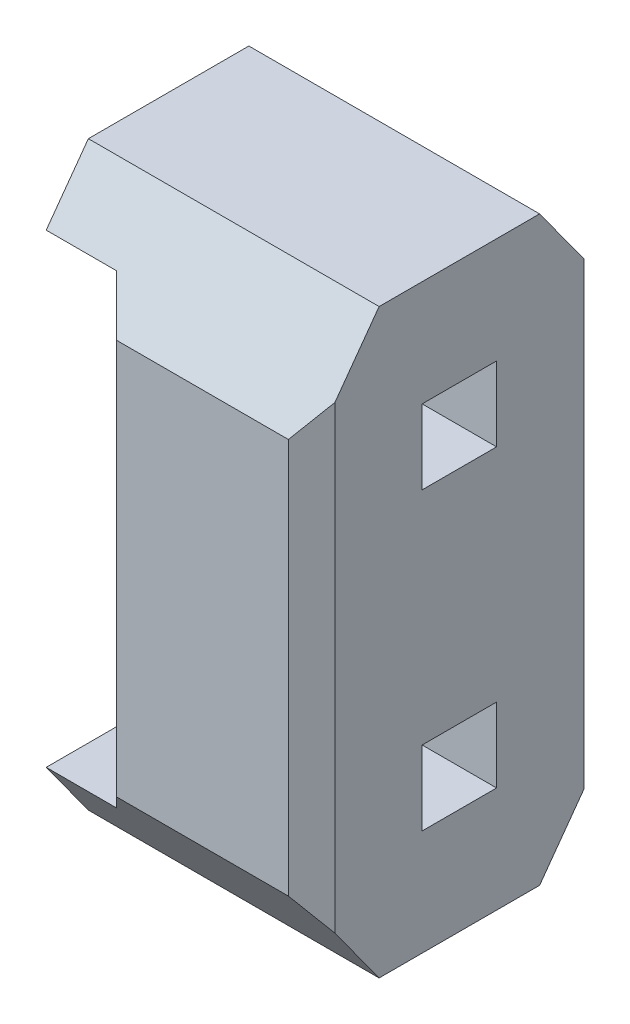
ISO-10303-21;
HEADER;
FILE_DESCRIPTION(('STEP AP214'),'2;1');
FILE_NAME('part.step','',(''),(''),'','','');
FILE_SCHEMA(('AUTOMOTIVE_DESIGN { 1 0 10303 214 1 1 1 1 }'));
ENDSEC;
DATA;
#1=APPLICATION_CONTEXT('core data for automotive mechanical design processes');
#2=APPLICATION_PROTOCOL_DEFINITION('international standard','automotive_design',2000,#1);
#3=PRODUCT_CONTEXT('',#1,'mechanical');
#4=PRODUCT('Part','Part','',(#3));
#5=PRODUCT_RELATED_PRODUCT_CATEGORY('part','',(#4));
#6=PRODUCT_DEFINITION_FORMATION('','',#4);
#7=PRODUCT_DEFINITION_CONTEXT('part definition',#1,'design');
#8=PRODUCT_DEFINITION('design','',#6,#7);
#9=PRODUCT_DEFINITION_SHAPE('','',#8);
#10=(LENGTH_UNIT() NAMED_UNIT(*) SI_UNIT(.MILLI.,.METRE.));
#11=(NAMED_UNIT(*) PLANE_ANGLE_UNIT() SI_UNIT($,.RADIAN.));
#12=(NAMED_UNIT(*) SI_UNIT($,.STERADIAN.) SOLID_ANGLE_UNIT());
#13=UNCERTAINTY_MEASURE_WITH_UNIT(LENGTH_MEASURE(1.E-05),#10,'distance_accuracy_value','');
#14=(GEOMETRIC_REPRESENTATION_CONTEXT(3) GLOBAL_UNCERTAINTY_ASSIGNED_CONTEXT((#13)) GLOBAL_UNIT_ASSIGNED_CONTEXT((#10,
#11,#12)) REPRESENTATION_CONTEXT('',''));
#15=CARTESIAN_POINT('',(0.,0.,0.));
#16=DIRECTION('',(0.,0.,1.));
#17=DIRECTION('',(1.,0.,0.));
#18=AXIS2_PLACEMENT_3D('',#15,#16,#17);
#19=CARTESIAN_POINT('',(1.25,4.6,-5.37));
#20=DIRECTION('',(0.,0.586967571460905,0.809610443394407));
#21=DIRECTION('',(0.,-0.809610443394407,0.586967571460905));
#22=AXIS2_PLACEMENT_3D('',#19,#20,#21);
#23=PLANE('',#22);
#24=DIRECTION('',(1.,0.,0.));
#25=VECTOR('',#24,1.);
#26=CARTESIAN_POINT('',(1.25,4.5,-5.2975));
#27=LINE('',#26,#25);
#28=CARTESIAN_POINT('',(0.,4.5,-5.2975));
#29=VERTEX_POINT('',#28);
#30=CARTESIAN_POINT('',(0.602500000000036,4.5,-5.29750000000004));
#31=VERTEX_POINT('',#30);
#32=EDGE_CURVE('E199',#29,#31,#27,.T.);
#33=ORIENTED_EDGE('',*,*,#32,.T.);
#34=DIRECTION('',(0.506207656349388,-0.698217457033655,0.506207656349364));
#35=VECTOR('',#34,1.);
#36=CARTESIAN_POINT('',(0.6025,4.5,-5.2975));
#37=LINE('',#36,#35);
#38=CARTESIAN_POINT('',(0.819999999999963,4.2,-5.07999999999997));
#39=VERTEX_POINT('',#38);
#40=EDGE_CURVE('E197',#31,#39,#37,.T.);
#41=ORIENTED_EDGE('',*,*,#40,.T.);
#42=DIRECTION('',(1.,0.,0.));
#43=VECTOR('',#42,1.);
#44=CARTESIAN_POINT('',(1.25,4.19999999999999,-5.08000000000001));
#45=LINE('',#44,#43);
#46=CARTESIAN_POINT('',(2.3,4.2,-5.08000000000001));
#47=VERTEX_POINT('',#46);
#48=EDGE_CURVE('E20',#39,#47,#45,.T.);
#49=ORIENTED_EDGE('',*,*,#48,.T.);
#50=DIRECTION('',(0.506207656348957,0.698217457033859,-0.506207656349514));
#51=VECTOR('',#50,1.);
#52=CARTESIAN_POINT('',(2.3,4.19999999999999,-5.08000000000001));
#53=LINE('',#52,#51);
#54=CARTESIAN_POINT('',(2.5,4.47586206896591,-5.28000000000012));
#55=VERTEX_POINT('',#54);
#56=EDGE_CURVE('E181',#47,#55,#53,.T.);
#57=ORIENTED_EDGE('',*,*,#56,.T.);
#58=DIRECTION('',(0.,-0.809610443394407,0.586967571460905));
#59=VECTOR('',#58,1.);
#60=CARTESIAN_POINT('',(2.5,4.6,-5.37));
#61=LINE('',#60,#59);
#62=CARTESIAN_POINT('',(2.5,5.,-5.65999999999999));
#63=VERTEX_POINT('',#62);
#64=EDGE_CURVE('E188',#55,#63,#61,.F.);
#65=ORIENTED_EDGE('',*,*,#64,.T.);
#66=DIRECTION('',(1.,0.,0.));
#67=VECTOR('',#66,1.);
#68=CARTESIAN_POINT('',(1.25,5.,-5.66));
#69=LINE('',#68,#67);
#70=CARTESIAN_POINT('',(0.,5.,-5.65999999999999));
#71=VERTEX_POINT('',#70);
#72=EDGE_CURVE('E215',#71,#63,#69,.T.);
#73=ORIENTED_EDGE('',*,*,#72,.F.);
#74=DIRECTION('',(0.,-0.809610443394407,0.586967571460905));
#75=VECTOR('',#74,1.);
#76=CARTESIAN_POINT('',(0.,4.6,-5.37));
#77=LINE('',#76,#75);
#78=EDGE_CURVE('E207',#71,#29,#77,.T.);
#79=ORIENTED_EDGE('',*,*,#78,.T.);
#80=EDGE_LOOP('',(#33,#41,#49,#57,#65,#73,#79));
#81=FACE_BOUND('',#80,.T.);
#82=ADVANCED_FACE('F17',(#81),#23,.T.);
#83=CARTESIAN_POINT('',(1.25,4.6,-7.33));
#84=DIRECTION('',(0.,-0.586967571460905,0.809610443394407));
#85=DIRECTION('',(0.,-0.809610443394407,-0.586967571460905));
#86=AXIS2_PLACEMENT_3D('',#83,#84,#85);
#87=PLANE('',#86);
#88=DIRECTION('',(0.,-0.809610443394407,-0.586967571460905));
#89=VECTOR('',#88,1.);
#90=CARTESIAN_POINT('',(0.,4.6,-7.33));
#91=LINE('',#90,#89);
#92=CARTESIAN_POINT('',(0.,5.,-7.04000000000001));
#93=VERTEX_POINT('',#92);
#94=CARTESIAN_POINT('',(0.,4.5,-7.4025));
#95=VERTEX_POINT('',#94);
#96=EDGE_CURVE('E263',#93,#95,#91,.T.);
#97=ORIENTED_EDGE('',*,*,#96,.F.);
#98=DIRECTION('',(1.,0.,0.));
#99=VECTOR('',#98,1.);
#100=CARTESIAN_POINT('',(1.25,5.,-7.04));
#101=LINE('',#100,#99);
#102=CARTESIAN_POINT('',(2.5,5.,-7.04));
#103=VERTEX_POINT('',#102);
#104=EDGE_CURVE('E227',#103,#93,#101,.F.);
#105=ORIENTED_EDGE('',*,*,#104,.F.);
#106=DIRECTION('',(0.,-0.809610443394407,-0.586967571460905));
#107=VECTOR('',#106,1.);
#108=CARTESIAN_POINT('',(2.5,4.6,-7.33));
#109=LINE('',#108,#107);
#110=CARTESIAN_POINT('',(2.5,4.47586206896592,-7.41999999999988));
#111=VERTEX_POINT('',#110);
#112=EDGE_CURVE('E223',#111,#103,#109,.F.);
#113=ORIENTED_EDGE('',*,*,#112,.F.);
#114=DIRECTION('',(0.506207656348956,0.69821745703386,0.506207656349513));
#115=VECTOR('',#114,1.);
#116=CARTESIAN_POINT('',(2.3,4.19999999999999,-7.61999999999999));
#117=LINE('',#116,#115);
#118=CARTESIAN_POINT('',(2.3,4.2,-7.61999999999999));
#119=VERTEX_POINT('',#118);
#120=EDGE_CURVE('E266',#119,#111,#117,.T.);
#121=ORIENTED_EDGE('',*,*,#120,.F.);
#122=DIRECTION('',(1.,0.,0.));
#123=VECTOR('',#122,1.);
#124=CARTESIAN_POINT('',(1.25,4.19999999999999,-7.61999999999999));
#125=LINE('',#124,#123);
#126=CARTESIAN_POINT('',(0.819999999999963,4.2,-7.62000000000003));
#127=VERTEX_POINT('',#126);
#128=EDGE_CURVE('E205',#127,#119,#125,.T.);
#129=ORIENTED_EDGE('',*,*,#128,.F.);
#130=DIRECTION('',(0.506207656349388,-0.698217457033654,-0.506207656349365));
#131=VECTOR('',#130,1.);
#132=CARTESIAN_POINT('',(0.6025,4.5,-7.4025));
#133=LINE('',#132,#131);
#134=CARTESIAN_POINT('',(0.602500000000036,4.5,-7.40249999999996));
#135=VERTEX_POINT('',#134);
#136=EDGE_CURVE('E203',#135,#127,#133,.T.);
#137=ORIENTED_EDGE('',*,*,#136,.F.);
#138=DIRECTION('',(1.,0.,0.));
#139=VECTOR('',#138,1.);
#140=CARTESIAN_POINT('',(1.25,4.5,-7.4025));
#141=LINE('',#140,#139);
#142=EDGE_CURVE('E261',#95,#135,#141,.T.);
#143=ORIENTED_EDGE('',*,*,#142,.F.);
#144=EDGE_LOOP('',(#97,#105,#113,#121,#129,#137,#143));
#145=FACE_BOUND('',#144,.T.);
#146=ADVANCED_FACE('F285',(#145),#87,.F.);
#147=CARTESIAN_POINT('',(1.25,0.4,-7.33));
#148=DIRECTION('',(0.,0.586967571460905,0.809610443394407));
#149=DIRECTION('',(0.,-0.809610443394407,0.586967571460905));
#150=AXIS2_PLACEMENT_3D('',#147,#148,#149);
#151=PLANE('',#150);
#152=DIRECTION('',(-0.506207656349404,0.698217457033647,-0.506207656349359));
#153=VECTOR('',#152,1.);
#154=CARTESIAN_POINT('',(2.5,0.524137931034497,-7.42));
#155=LINE('',#154,#153);
#156=CARTESIAN_POINT('',(2.5,0.524137931034498,-7.42));
#157=VERTEX_POINT('',#156);
#158=CARTESIAN_POINT('',(2.3,0.800000000000004,-7.61999999999999));
#159=VERTEX_POINT('',#158);
#160=EDGE_CURVE('E251',#157,#159,#155,.T.);
#161=ORIENTED_EDGE('',*,*,#160,.F.);
#162=DIRECTION('',(0.,-0.809610443394407,0.586967571460905));
#163=VECTOR('',#162,1.);
#164=CARTESIAN_POINT('',(2.5,0.4,-7.33));
#165=LINE('',#164,#163);
#166=CARTESIAN_POINT('',(2.5,0.,-7.04));
#167=VERTEX_POINT('',#166);
#168=EDGE_CURVE('E253',#167,#157,#165,.F.);
#169=ORIENTED_EDGE('',*,*,#168,.F.);
#170=DIRECTION('',(1.,0.,0.));
#171=VECTOR('',#170,1.);
#172=CARTESIAN_POINT('',(1.25,0.,-7.04));
#173=LINE('',#172,#171);
#174=CARTESIAN_POINT('',(0.,0.,-7.04000000000001));
#175=VERTEX_POINT('',#174);
#176=EDGE_CURVE('E288',#167,#175,#173,.F.);
#177=ORIENTED_EDGE('',*,*,#176,.T.);
#178=DIRECTION('',(0.,-0.809610443394407,0.586967571460905));
#179=VECTOR('',#178,1.);
#180=CARTESIAN_POINT('',(0.,0.4,-7.33));
#181=LINE('',#180,#179);
#182=CARTESIAN_POINT('',(0.,0.500000000000001,-7.4025));
#183=VERTEX_POINT('',#182);
#184=EDGE_CURVE('E255',#183,#175,#181,.T.);
#185=ORIENTED_EDGE('',*,*,#184,.F.);
#186=DIRECTION('',(1.,0.,0.));
#187=VECTOR('',#186,1.);
#188=CARTESIAN_POINT('',(1.25,0.500000000000002,-7.4025));
#189=LINE('',#188,#187);
#190=CARTESIAN_POINT('',(0.602500000000036,0.500000000000001,-7.40249999999996));
#191=VERTEX_POINT('',#190);
#192=EDGE_CURVE('E257',#191,#183,#189,.F.);
#193=ORIENTED_EDGE('',*,*,#192,.F.);
#194=DIRECTION('',(-0.506207656349388,-0.698217457033655,0.506207656349364));
#195=VECTOR('',#194,1.);
#196=CARTESIAN_POINT('',(0.82,0.800000000000009,-7.61999999999999));
#197=LINE('',#196,#195);
#198=CARTESIAN_POINT('',(0.819999999999963,0.800000000000004,-7.62000000000003));
#199=VERTEX_POINT('',#198);
#200=EDGE_CURVE('E259',#199,#191,#197,.T.);
#201=ORIENTED_EDGE('',*,*,#200,.F.);
#202=DIRECTION('',(1.,0.,0.));
#203=VECTOR('',#202,1.);
#204=CARTESIAN_POINT('',(1.25,0.800000000000009,-7.61999999999999));
#205=LINE('',#204,#203);
#206=EDGE_CURVE('E249',#159,#199,#205,.F.);
#207=ORIENTED_EDGE('',*,*,#206,.F.);
#208=EDGE_LOOP('',(#161,#169,#177,#185,#193,#201,#207));
#209=FACE_BOUND('',#208,.T.);
#210=ADVANCED_FACE('F431',(#209),#151,.F.);
#211=CARTESIAN_POINT('',(1.25,0.4,-5.37));
#212=DIRECTION('',(0.,-0.586967571460905,0.809610443394407));
#213=DIRECTION('',(0.,-0.809610443394407,-0.586967571460905));
#214=AXIS2_PLACEMENT_3D('',#211,#212,#213);
#215=PLANE('',#214);
#216=DIRECTION('',(1.,0.,0.));
#217=VECTOR('',#216,1.);
#218=CARTESIAN_POINT('',(1.25,0.80000000000001,-5.08000000000001));
#219=LINE('',#218,#217);
#220=CARTESIAN_POINT('',(2.3,0.800000000000004,-5.08000000000001));
#221=VERTEX_POINT('',#220);
#222=CARTESIAN_POINT('',(0.819999999999963,0.800000000000005,-5.07999999999997));
#223=VERTEX_POINT('',#222);
#224=EDGE_CURVE('E191',#221,#223,#219,.F.);
#225=ORIENTED_EDGE('',*,*,#224,.T.);
#226=DIRECTION('',(-0.506207656349388,-0.698217457033655,-0.506207656349365));
#227=VECTOR('',#226,1.);
#228=CARTESIAN_POINT('',(0.82,0.80000000000001,-5.08000000000001));
#229=LINE('',#228,#227);
#230=CARTESIAN_POINT('',(0.602500000000036,0.500000000000001,-5.29750000000004));
#231=VERTEX_POINT('',#230);
#232=EDGE_CURVE('E232',#223,#231,#229,.T.);
#233=ORIENTED_EDGE('',*,*,#232,.T.);
#234=DIRECTION('',(1.,0.,0.));
#235=VECTOR('',#234,1.);
#236=CARTESIAN_POINT('',(1.25,0.500000000000003,-5.2975));
#237=LINE('',#236,#235);
#238=CARTESIAN_POINT('',(0.,0.500000000000001,-5.2975));
#239=VERTEX_POINT('',#238);
#240=EDGE_CURVE('E246',#231,#239,#237,.F.);
#241=ORIENTED_EDGE('',*,*,#240,.T.);
#242=DIRECTION('',(0.,-0.809610443394407,-0.586967571460905));
#243=VECTOR('',#242,1.);
#244=CARTESIAN_POINT('',(0.,0.4,-5.37));
#245=LINE('',#244,#243);
#246=CARTESIAN_POINT('',(0.,0.,-5.65999999999999));
#247=VERTEX_POINT('',#246);
#248=EDGE_CURVE('E244',#239,#247,#245,.T.);
#249=ORIENTED_EDGE('',*,*,#248,.T.);
#250=DIRECTION('',(1.,0.,0.));
#251=VECTOR('',#250,1.);
#252=CARTESIAN_POINT('',(1.25,0.,-5.66));
#253=LINE('',#252,#251);
#254=CARTESIAN_POINT('',(2.5,0.,-5.66));
#255=VERTEX_POINT('',#254);
#256=EDGE_CURVE('E293',#247,#255,#253,.T.);
#257=ORIENTED_EDGE('',*,*,#256,.T.);
#258=DIRECTION('',(0.,-0.809610443394407,-0.586967571460905));
#259=VECTOR('',#258,1.);
#260=CARTESIAN_POINT('',(2.5,0.4,-5.37));
#261=LINE('',#260,#259);
#262=CARTESIAN_POINT('',(2.5,0.524137931034498,-5.28));
#263=VERTEX_POINT('',#262);
#264=EDGE_CURVE('E241',#255,#263,#261,.F.);
#265=ORIENTED_EDGE('',*,*,#264,.T.);
#266=DIRECTION('',(-0.506207656349403,0.698217457033647,0.50620765634936));
#267=VECTOR('',#266,1.);
#268=CARTESIAN_POINT('',(2.5,0.524137931034497,-5.28));
#269=LINE('',#268,#267);
#270=EDGE_CURVE('E239',#263,#221,#269,.T.);
#271=ORIENTED_EDGE('',*,*,#270,.T.);
#272=EDGE_LOOP('',(#225,#233,#241,#249,#257,#265,#271));
#273=FACE_BOUND('',#272,.T.);
#274=ADVANCED_FACE('F421',(#273),#215,.T.);
#275=CARTESIAN_POINT('',(1.25,5.,-6.35));
#276=DIRECTION('',(0.,1.,0.));
#277=DIRECTION('',(0.,0.,1.));
#278=AXIS2_PLACEMENT_3D('',#275,#276,#277);
#279=PLANE('',#278);
#280=ORIENTED_EDGE('',*,*,#104,.T.);
#281=DIRECTION('',(0.,0.,-1.));
#282=VECTOR('',#281,1.);
#283=CARTESIAN_POINT('',(0.,5.,-6.35));
#284=LINE('',#283,#282);
#285=EDGE_CURVE('E231',#93,#71,#284,.F.);
#286=ORIENTED_EDGE('',*,*,#285,.T.);
#287=ORIENTED_EDGE('',*,*,#72,.T.);
#288=DIRECTION('',(0.,0.,1.));
#289=VECTOR('',#288,1.);
#290=CARTESIAN_POINT('',(2.5,5.,-6.35));
#291=LINE('',#290,#289);
#292=EDGE_CURVE('E219',#63,#103,#291,.F.);
#293=ORIENTED_EDGE('',*,*,#292,.T.);
#294=EDGE_LOOP('',(#280,#286,#287,#293));
#295=FACE_BOUND('',#294,.T.);
#296=ADVANCED_FACE('F229',(#295),#279,.T.);
#297=CARTESIAN_POINT('',(1.25,0.,-6.35));
#298=DIRECTION('',(0.,1.,0.));
#299=DIRECTION('',(0.,0.,1.));
#300=AXIS2_PLACEMENT_3D('',#297,#298,#299);
#301=PLANE('',#300);
#302=DIRECTION('',(0.,0.,-1.));
#303=VECTOR('',#302,1.);
#304=CARTESIAN_POINT('',(0.,0.,-6.35));
#305=LINE('',#304,#303);
#306=EDGE_CURVE('E297',#247,#175,#305,.T.);
#307=ORIENTED_EDGE('',*,*,#306,.T.);
#308=ORIENTED_EDGE('',*,*,#176,.F.);
#309=DIRECTION('',(0.,0.,1.));
#310=VECTOR('',#309,1.);
#311=CARTESIAN_POINT('',(2.5,0.,-6.35));
#312=LINE('',#311,#310);
#313=EDGE_CURVE('E287',#255,#167,#312,.F.);
#314=ORIENTED_EDGE('',*,*,#313,.F.);
#315=ORIENTED_EDGE('',*,*,#256,.F.);
#316=EDGE_LOOP('',(#307,#308,#314,#315));
#317=FACE_BOUND('',#316,.T.);
#318=ADVANCED_FACE('F428',(#317),#301,.F.);
#319=CARTESIAN_POINT('',(0.,4.75,-6.35));
#320=DIRECTION('',(1.,0.,0.));
#321=DIRECTION('',(0.,0.,-1.));
#322=AXIS2_PLACEMENT_3D('',#319,#320,#321);
#323=PLANE('',#322);
#324=ORIENTED_EDGE('',*,*,#285,.F.);
#325=ORIENTED_EDGE('',*,*,#96,.T.);
#326=DIRECTION('',(0.,0.,1.));
#327=VECTOR('',#326,1.);
#328=CARTESIAN_POINT('',(0.,4.5,-6.35));
#329=LINE('',#328,#327);
#330=EDGE_CURVE('E307',#95,#29,#329,.T.);
#331=ORIENTED_EDGE('',*,*,#330,.T.);
#332=ORIENTED_EDGE('',*,*,#78,.F.);
#333=EDGE_LOOP('',(#324,#325,#331,#332));
#334=FACE_BOUND('',#333,.T.);
#335=ADVANCED_FACE('F441',(#334),#323,.F.);
#336=CARTESIAN_POINT('',(0.,0.25,-6.35));
#337=DIRECTION('',(1.,0.,0.));
#338=DIRECTION('',(0.,0.,-1.));
#339=AXIS2_PLACEMENT_3D('',#336,#337,#338);
#340=PLANE('',#339);
#341=ORIENTED_EDGE('',*,*,#306,.F.);
#342=ORIENTED_EDGE('',*,*,#248,.F.);
#343=DIRECTION('',(0.,0.,1.));
#344=VECTOR('',#343,1.);
#345=CARTESIAN_POINT('',(0.,0.5,-6.35));
#346=LINE('',#345,#344);
#347=EDGE_CURVE('E315',#183,#239,#346,.T.);
#348=ORIENTED_EDGE('',*,*,#347,.F.);
#349=ORIENTED_EDGE('',*,*,#184,.T.);
#350=EDGE_LOOP('',(#341,#342,#348,#349));
#351=FACE_BOUND('',#350,.T.);
#352=ADVANCED_FACE('F443',(#351),#340,.F.);
#353=CARTESIAN_POINT('',(1.55,3.45,-6.35));
#354=DIRECTION('',(0.,1.,0.));
#355=DIRECTION('',(0.,0.,1.));
#356=AXIS2_PLACEMENT_3D('',#353,#354,#355);
#357=PLANE('',#356);
#358=DIRECTION('',(1.,0.,0.));
#359=VECTOR('',#358,1.);
#360=CARTESIAN_POINT('',(1.55,3.45,-6.67));
#361=LINE('',#360,#359);
#362=CARTESIAN_POINT('',(0.6,3.45,-6.67));
#363=VERTEX_POINT('',#362);
#364=CARTESIAN_POINT('',(2.5,3.45,-6.67));
#365=VERTEX_POINT('',#364);
#366=EDGE_CURVE('E332',#363,#365,#361,.T.);
#367=ORIENTED_EDGE('',*,*,#366,.F.);
#368=DIRECTION('',(0.,0.,1.));
#369=VECTOR('',#368,1.);
#370=CARTESIAN_POINT('',(0.6,3.45,-6.35));
#371=LINE('',#370,#369);
#372=CARTESIAN_POINT('',(0.6,3.45,-6.03));
#373=VERTEX_POINT('',#372);
#374=EDGE_CURVE('E302',#363,#373,#371,.T.);
#375=ORIENTED_EDGE('',*,*,#374,.T.);
#376=DIRECTION('',(1.,0.,0.));
#377=VECTOR('',#376,1.);
#378=CARTESIAN_POINT('',(1.55,3.45,-6.03));
#379=LINE('',#378,#377);
#380=CARTESIAN_POINT('',(2.5,3.45,-6.03));
#381=VERTEX_POINT('',#380);
#382=EDGE_CURVE('E327',#373,#381,#379,.T.);
#383=ORIENTED_EDGE('',*,*,#382,.T.);
#384=DIRECTION('',(0.,0.,1.));
#385=VECTOR('',#384,1.);
#386=CARTESIAN_POINT('',(2.5,3.45,-6.35));
#387=LINE('',#386,#385);
#388=EDGE_CURVE('E300',#381,#365,#387,.F.);
#389=ORIENTED_EDGE('',*,*,#388,.T.);
#390=EDGE_LOOP('',(#367,#375,#383,#389));
#391=FACE_BOUND('',#390,.T.);
#392=ADVANCED_FACE('F398',(#391),#357,.T.);
#393=CARTESIAN_POINT('',(0.71,2.5,-7.51));
#394=DIRECTION('',(0.707106781187498,0.,0.707106781185598));
#395=DIRECTION('',(0.707106781185598,0.,-0.707106781187498));
#396=AXIS2_PLACEMENT_3D('',#393,#394,#395);
#397=PLANE('',#396);
#398=ORIENTED_EDGE('',*,*,#200,.T.);
#399=DIRECTION('',(0.707106781186578,0.,-0.707106781186517));
#400=VECTOR('',#399,1.);
#401=CARTESIAN_POINT('',(0.6,0.5,-7.4));
#402=LINE('',#401,#400);
#403=CARTESIAN_POINT('',(0.600000000000074,0.5,-7.39999999999993));
#404=VERTEX_POINT('',#403);
#405=EDGE_CURVE('E312',#404,#191,#402,.T.);
#406=ORIENTED_EDGE('',*,*,#405,.F.);
#407=DIRECTION('',(0.,1.,0.));
#408=VECTOR('',#407,1.);
#409=CARTESIAN_POINT('',(0.6,2.5,-7.4));
#410=LINE('',#409,#408);
#411=CARTESIAN_POINT('',(0.600000000000074,4.5,-7.39999999999993));
#412=VERTEX_POINT('',#411);
#413=EDGE_CURVE('E337',#404,#412,#410,.T.);
#414=ORIENTED_EDGE('',*,*,#413,.T.);
#415=DIRECTION('',(0.707106781186578,0.,-0.707106781186517));
#416=VECTOR('',#415,1.);
#417=CARTESIAN_POINT('',(0.6,4.5,-7.4));
#418=LINE('',#417,#416);
#419=EDGE_CURVE('E304',#412,#135,#418,.T.);
#420=ORIENTED_EDGE('',*,*,#419,.T.);
#421=ORIENTED_EDGE('',*,*,#136,.T.);
#422=DIRECTION('',(0.,1.,0.));
#423=VECTOR('',#422,1.);
#424=CARTESIAN_POINT('',(0.82,2.5,-7.62));
#425=LINE('',#424,#423);
#426=EDGE_CURVE('E275',#127,#199,#425,.F.);
#427=ORIENTED_EDGE('',*,*,#426,.T.);
#428=EDGE_LOOP('',(#398,#406,#414,#420,#421,#427));
#429=FACE_BOUND('',#428,.T.);
#430=ADVANCED_FACE('F435',(#429),#397,.F.);
#431=CARTESIAN_POINT('',(0.30125,4.5,-6.35));
#432=DIRECTION('',(0.,1.,0.));
#433=DIRECTION('',(0.,0.,1.));
#434=AXIS2_PLACEMENT_3D('',#431,#432,#433);
#435=PLANE('',#434);
#436=ORIENTED_EDGE('',*,*,#142,.T.);
#437=ORIENTED_EDGE('',*,*,#419,.F.);
#438=DIRECTION('',(0.,0.,-1.));
#439=VECTOR('',#438,1.);
#440=CARTESIAN_POINT('',(0.6,4.5,-6.35));
#441=LINE('',#440,#439);
#442=CARTESIAN_POINT('',(0.600000000000037,4.5,-5.30000000000004));
#443=VERTEX_POINT('',#442);
#444=EDGE_CURVE('E339',#412,#443,#441,.F.);
#445=ORIENTED_EDGE('',*,*,#444,.T.);
#446=DIRECTION('',(-0.707106781185598,0.,-0.707106781187498));
#447=VECTOR('',#446,1.);
#448=CARTESIAN_POINT('',(0.71,4.5,-5.19));
#449=LINE('',#448,#447);
#450=EDGE_CURVE('E310',#443,#31,#449,.F.);
#451=ORIENTED_EDGE('',*,*,#450,.T.);
#452=ORIENTED_EDGE('',*,*,#32,.F.);
#453=ORIENTED_EDGE('',*,*,#330,.F.);
#454=EDGE_LOOP('',(#436,#437,#445,#451,#452,#453));
#455=FACE_BOUND('',#454,.T.);
#456=ADVANCED_FACE('F439',(#455),#435,.F.);
#457=CARTESIAN_POINT('',(0.71,2.5,-5.19));
#458=DIRECTION('',(0.707106781187498,0.,-0.707106781185598));
#459=DIRECTION('',(-0.707106781185598,0.,-0.707106781187498));
#460=AXIS2_PLACEMENT_3D('',#457,#458,#459);
#461=PLANE('',#460);
#462=ORIENTED_EDGE('',*,*,#232,.F.);
#463=DIRECTION('',(0.,1.,0.));
#464=VECTOR('',#463,1.);
#465=CARTESIAN_POINT('',(0.82,2.5,-5.08));
#466=LINE('',#465,#464);
#467=EDGE_CURVE('E325',#39,#223,#466,.F.);
#468=ORIENTED_EDGE('',*,*,#467,.F.);
#469=ORIENTED_EDGE('',*,*,#40,.F.);
#470=ORIENTED_EDGE('',*,*,#450,.F.);
#471=DIRECTION('',(0.,1.,0.));
#472=VECTOR('',#471,1.);
#473=CARTESIAN_POINT('',(0.6,2.5,-5.3));
#474=LINE('',#473,#472);
#475=CARTESIAN_POINT('',(0.600000000000074,0.5,-5.30000000000007));
#476=VERTEX_POINT('',#475);
#477=EDGE_CURVE('E341',#443,#476,#474,.F.);
#478=ORIENTED_EDGE('',*,*,#477,.T.);
#479=DIRECTION('',(-0.707106781186578,0.,-0.707106781186517));
#480=VECTOR('',#479,1.);
#481=CARTESIAN_POINT('',(0.6025,0.5,-5.2975));
#482=LINE('',#481,#480);
#483=EDGE_CURVE('E318',#231,#476,#482,.T.);
#484=ORIENTED_EDGE('',*,*,#483,.F.);
#485=EDGE_LOOP('',(#462,#468,#469,#470,#478,#484));
#486=FACE_BOUND('',#485,.T.);
#487=ADVANCED_FACE('F416',(#486),#461,.F.);
#488=CARTESIAN_POINT('',(0.30125,0.5,-6.35));
#489=DIRECTION('',(0.,1.,0.));
#490=DIRECTION('',(0.,0.,1.));
#491=AXIS2_PLACEMENT_3D('',#488,#489,#490);
#492=PLANE('',#491);
#493=ORIENTED_EDGE('',*,*,#483,.T.);
#494=DIRECTION('',(0.,0.,-1.));
#495=VECTOR('',#494,1.);
#496=CARTESIAN_POINT('',(0.6,0.5,-6.35));
#497=LINE('',#496,#495);
#498=EDGE_CURVE('E343',#476,#404,#497,.T.);
#499=ORIENTED_EDGE('',*,*,#498,.T.);
#500=ORIENTED_EDGE('',*,*,#405,.T.);
#501=ORIENTED_EDGE('',*,*,#192,.T.);
#502=ORIENTED_EDGE('',*,*,#347,.T.);
#503=ORIENTED_EDGE('',*,*,#240,.F.);
#504=EDGE_LOOP('',(#493,#499,#500,#501,#502,#503));
#505=FACE_BOUND('',#504,.T.);
#506=ADVANCED_FACE('F418',(#505),#492,.T.);
#507=CARTESIAN_POINT('',(1.55,1.23,-6.67));
#508=DIRECTION('',(0.,0.,1.));
#509=DIRECTION('',(1.,0.,0.));
#510=AXIS2_PLACEMENT_3D('',#507,#508,#509);
#511=PLANE('',#510);
#512=DIRECTION('',(1.,0.,0.));
#513=VECTOR('',#512,1.);
#514=CARTESIAN_POINT('',(1.55,1.55,-6.67));
#515=LINE('',#514,#513);
#516=CARTESIAN_POINT('',(2.5,1.55,-6.67));
#517=VERTEX_POINT('',#516);
#518=CARTESIAN_POINT('',(0.6,1.55,-6.67));
#519=VERTEX_POINT('',#518);
#520=EDGE_CURVE('E283',#517,#519,#515,.F.);
#521=ORIENTED_EDGE('',*,*,#520,.T.);
#522=DIRECTION('',(0.,1.,0.));
#523=VECTOR('',#522,1.);
#524=CARTESIAN_POINT('',(0.6,2.5,-6.67));
#525=LINE('',#524,#523);
#526=CARTESIAN_POINT('',(0.6,0.91,-6.67));
#527=VERTEX_POINT('',#526);
#528=EDGE_CURVE('E346',#519,#527,#525,.F.);
#529=ORIENTED_EDGE('',*,*,#528,.T.);
#530=DIRECTION('',(1.,0.,0.));
#531=VECTOR('',#530,1.);
#532=CARTESIAN_POINT('',(1.55,0.91,-6.67));
#533=LINE('',#532,#531);
#534=CARTESIAN_POINT('',(2.5,0.91,-6.67));
#535=VERTEX_POINT('',#534);
#536=EDGE_CURVE('E354',#535,#527,#533,.F.);
#537=ORIENTED_EDGE('',*,*,#536,.F.);
#538=DIRECTION('',(0.,1.,0.));
#539=VECTOR('',#538,1.);
#540=CARTESIAN_POINT('',(2.5,1.23,-6.67));
#541=LINE('',#540,#539);
#542=EDGE_CURVE('E321',#535,#517,#541,.T.);
#543=ORIENTED_EDGE('',*,*,#542,.T.);
#544=EDGE_LOOP('',(#521,#529,#537,#543));
#545=FACE_BOUND('',#544,.T.);
#546=ADVANCED_FACE('F483',(#545),#511,.T.);
#547=CARTESIAN_POINT('',(1.56,2.5,-7.62));
#548=DIRECTION('',(0.,0.,1.));
#549=DIRECTION('',(1.,0.,0.));
#550=AXIS2_PLACEMENT_3D('',#547,#548,#549);
#551=PLANE('',#550);
#552=DIRECTION('',(0.,1.,0.));
#553=VECTOR('',#552,1.);
#554=CARTESIAN_POINT('',(2.3,2.5,-7.62));
#555=LINE('',#554,#553);
#556=EDGE_CURVE('E193',#159,#119,#555,.T.);
#557=ORIENTED_EDGE('',*,*,#556,.F.);
#558=ORIENTED_EDGE('',*,*,#206,.T.);
#559=ORIENTED_EDGE('',*,*,#426,.F.);
#560=ORIENTED_EDGE('',*,*,#128,.T.);
#561=EDGE_LOOP('',(#557,#558,#559,#560));
#562=FACE_BOUND('',#561,.T.);
#563=ADVANCED_FACE('F272',(#562),#551,.F.);
#564=CARTESIAN_POINT('',(1.56,2.5,-5.08));
#565=DIRECTION('',(0.,0.,1.));
#566=DIRECTION('',(1.,0.,0.));
#567=AXIS2_PLACEMENT_3D('',#564,#565,#566);
#568=PLANE('',#567);
#569=ORIENTED_EDGE('',*,*,#48,.F.);
#570=ORIENTED_EDGE('',*,*,#467,.T.);
#571=ORIENTED_EDGE('',*,*,#224,.F.);
#572=DIRECTION('',(0.,1.,0.));
#573=VECTOR('',#572,1.);
#574=CARTESIAN_POINT('',(2.3,2.5,-5.08));
#575=LINE('',#574,#573);
#576=EDGE_CURVE('E183',#47,#221,#575,.F.);
#577=ORIENTED_EDGE('',*,*,#576,.F.);
#578=EDGE_LOOP('',(#569,#570,#571,#577));
#579=FACE_BOUND('',#578,.T.);
#580=ADVANCED_FACE('F189',(#579),#568,.T.);
#581=CARTESIAN_POINT('',(1.55,3.77,-6.03));
#582=DIRECTION('',(0.,0.,1.));
#583=DIRECTION('',(1.,0.,0.));
#584=AXIS2_PLACEMENT_3D('',#581,#582,#583);
#585=PLANE('',#584);
#586=DIRECTION('',(0.,1.,0.));
#587=VECTOR('',#586,1.);
#588=CARTESIAN_POINT('',(2.5,3.77,-6.03));
#589=LINE('',#588,#587);
#590=CARTESIAN_POINT('',(2.5,4.09,-6.03));
#591=VERTEX_POINT('',#590);
#592=EDGE_CURVE('E330',#381,#591,#589,.T.);
#593=ORIENTED_EDGE('',*,*,#592,.F.);
#594=ORIENTED_EDGE('',*,*,#382,.F.);
#595=DIRECTION('',(0.,1.,0.));
#596=VECTOR('',#595,1.);
#597=CARTESIAN_POINT('',(0.6,2.5,-6.03));
#598=LINE('',#597,#596);
#599=CARTESIAN_POINT('',(0.6,4.09,-6.03));
#600=VERTEX_POINT('',#599);
#601=EDGE_CURVE('E351',#373,#600,#598,.T.);
#602=ORIENTED_EDGE('',*,*,#601,.T.);
#603=DIRECTION('',(1.,0.,0.));
#604=VECTOR('',#603,1.);
#605=CARTESIAN_POINT('',(1.55,4.09,-6.03));
#606=LINE('',#605,#604);
#607=EDGE_CURVE('E368',#600,#591,#606,.T.);
#608=ORIENTED_EDGE('',*,*,#607,.T.);
#609=EDGE_LOOP('',(#593,#594,#602,#608));
#610=FACE_BOUND('',#609,.T.);
#611=ADVANCED_FACE('F402',(#610),#585,.F.);
#612=CARTESIAN_POINT('',(1.55,3.77,-6.67));
#613=DIRECTION('',(0.,0.,1.));
#614=DIRECTION('',(1.,0.,0.));
#615=AXIS2_PLACEMENT_3D('',#612,#613,#614);
#616=PLANE('',#615);
#617=DIRECTION('',(1.,0.,0.));
#618=VECTOR('',#617,1.);
#619=CARTESIAN_POINT('',(1.55,4.09,-6.67));
#620=LINE('',#619,#618);
#621=CARTESIAN_POINT('',(2.5,4.09,-6.67));
#622=VERTEX_POINT('',#621);
#623=CARTESIAN_POINT('',(0.6,4.09,-6.67));
#624=VERTEX_POINT('',#623);
#625=EDGE_CURVE('E371',#622,#624,#620,.F.);
#626=ORIENTED_EDGE('',*,*,#625,.T.);
#627=DIRECTION('',(0.,1.,0.));
#628=VECTOR('',#627,1.);
#629=CARTESIAN_POINT('',(0.6,2.5,-6.67));
#630=LINE('',#629,#628);
#631=EDGE_CURVE('E348',#624,#363,#630,.F.);
#632=ORIENTED_EDGE('',*,*,#631,.T.);
#633=ORIENTED_EDGE('',*,*,#366,.T.);
#634=DIRECTION('',(0.,1.,0.));
#635=VECTOR('',#634,1.);
#636=CARTESIAN_POINT('',(2.5,3.77,-6.67));
#637=LINE('',#636,#635);
#638=EDGE_CURVE('E335',#365,#622,#637,.T.);
#639=ORIENTED_EDGE('',*,*,#638,.T.);
#640=EDGE_LOOP('',(#626,#632,#633,#639));
#641=FACE_BOUND('',#640,.T.);
#642=ADVANCED_FACE('F395',(#641),#616,.T.);
#643=CARTESIAN_POINT('',(0.6,2.5,-6.35));
#644=DIRECTION('',(1.,0.,0.));
#645=DIRECTION('',(0.,0.,-1.));
#646=AXIS2_PLACEMENT_3D('',#643,#644,#645);
#647=PLANE('',#646);
#648=ORIENTED_EDGE('',*,*,#374,.F.);
#649=ORIENTED_EDGE('',*,*,#631,.F.);
#650=DIRECTION('',(0.,0.,1.));
#651=VECTOR('',#650,1.);
#652=CARTESIAN_POINT('',(0.6,4.09,-6.35));
#653=LINE('',#652,#651);
#654=EDGE_CURVE('E192',#624,#600,#653,.T.);
#655=ORIENTED_EDGE('',*,*,#654,.T.);
#656=ORIENTED_EDGE('',*,*,#601,.F.);
#657=EDGE_LOOP('',(#648,#649,#655,#656));
#658=FACE_BOUND('',#657,.T.);
#659=ORIENTED_EDGE('',*,*,#528,.F.);
#660=DIRECTION('',(0.,0.,1.));
#661=VECTOR('',#660,1.);
#662=CARTESIAN_POINT('',(0.6,1.55,-6.35));
#663=LINE('',#662,#661);
#664=CARTESIAN_POINT('',(0.6,1.55,-6.03));
#665=VERTEX_POINT('',#664);
#666=EDGE_CURVE('E360',#519,#665,#663,.T.);
#667=ORIENTED_EDGE('',*,*,#666,.T.);
#668=DIRECTION('',(0.,1.,0.));
#669=VECTOR('',#668,1.);
#670=CARTESIAN_POINT('',(0.6,1.23,-6.03));
#671=LINE('',#670,#669);
#672=CARTESIAN_POINT('',(0.6,0.91,-6.03));
#673=VERTEX_POINT('',#672);
#674=EDGE_CURVE('E374',#665,#673,#671,.F.);
#675=ORIENTED_EDGE('',*,*,#674,.T.);
#676=DIRECTION('',(0.,0.,1.));
#677=VECTOR('',#676,1.);
#678=CARTESIAN_POINT('',(0.6,0.91,-6.35));
#679=LINE('',#678,#677);
#680=EDGE_CURVE('E357',#527,#673,#679,.T.);
#681=ORIENTED_EDGE('',*,*,#680,.F.);
#682=EDGE_LOOP('',(#659,#667,#675,#681));
#683=FACE_BOUND('',#682,.T.);
#684=ORIENTED_EDGE('',*,*,#477,.F.);
#685=ORIENTED_EDGE('',*,*,#444,.F.);
#686=ORIENTED_EDGE('',*,*,#413,.F.);
#687=ORIENTED_EDGE('',*,*,#498,.F.);
#688=EDGE_LOOP('',(#684,#685,#686,#687));
#689=FACE_BOUND('',#688,.T.);
#690=ADVANCED_FACE('F404',(#658,#683,#689),#647,.F.);
#691=CARTESIAN_POINT('',(1.55,0.91,-6.35));
#692=DIRECTION('',(0.,1.,0.));
#693=DIRECTION('',(0.,0.,1.));
#694=AXIS2_PLACEMENT_3D('',#691,#692,#693);
#695=PLANE('',#694);
#696=ORIENTED_EDGE('',*,*,#536,.T.);
#697=ORIENTED_EDGE('',*,*,#680,.T.);
#698=DIRECTION('',(1.,0.,0.));
#699=VECTOR('',#698,1.);
#700=CARTESIAN_POINT('',(1.55,0.91,-6.03));
#701=LINE('',#700,#699);
#702=CARTESIAN_POINT('',(2.5,0.91,-6.03));
#703=VERTEX_POINT('',#702);
#704=EDGE_CURVE('E376',#673,#703,#701,.T.);
#705=ORIENTED_EDGE('',*,*,#704,.T.);
#706=DIRECTION('',(0.,0.,1.));
#707=VECTOR('',#706,1.);
#708=CARTESIAN_POINT('',(2.5,0.91,-6.35));
#709=LINE('',#708,#707);
#710=EDGE_CURVE('E34',#703,#535,#709,.F.);
#711=ORIENTED_EDGE('',*,*,#710,.T.);
#712=EDGE_LOOP('',(#696,#697,#705,#711));
#713=FACE_BOUND('',#712,.T.);
#714=ADVANCED_FACE('F407',(#713),#695,.T.);
#715=CARTESIAN_POINT('',(1.55,1.55,-6.35));
#716=DIRECTION('',(0.,1.,0.));
#717=DIRECTION('',(0.,0.,1.));
#718=AXIS2_PLACEMENT_3D('',#715,#716,#717);
#719=PLANE('',#718);
#720=DIRECTION('',(0.,0.,1.));
#721=VECTOR('',#720,1.);
#722=CARTESIAN_POINT('',(2.5,1.55,-6.35));
#723=LINE('',#722,#721);
#724=CARTESIAN_POINT('',(2.5,1.55,-6.03));
#725=VERTEX_POINT('',#724);
#726=EDGE_CURVE('E362',#725,#517,#723,.F.);
#727=ORIENTED_EDGE('',*,*,#726,.F.);
#728=DIRECTION('',(1.,0.,0.));
#729=VECTOR('',#728,1.);
#730=CARTESIAN_POINT('',(1.55,1.55,-6.03));
#731=LINE('',#730,#729);
#732=EDGE_CURVE('E378',#725,#665,#731,.F.);
#733=ORIENTED_EDGE('',*,*,#732,.T.);
#734=ORIENTED_EDGE('',*,*,#666,.F.);
#735=ORIENTED_EDGE('',*,*,#520,.F.);
#736=EDGE_LOOP('',(#727,#733,#734,#735));
#737=FACE_BOUND('',#736,.T.);
#738=ADVANCED_FACE('F468',(#737),#719,.F.);
#739=CARTESIAN_POINT('',(2.4,2.5,-7.52));
#740=DIRECTION('',(0.707106781186548,0.,-0.707106781186548));
#741=DIRECTION('',(-0.707106781186548,0.,-0.707106781186548));
#742=AXIS2_PLACEMENT_3D('',#739,#740,#741);
#743=PLANE('',#742);
#744=DIRECTION('',(0.,1.,0.));
#745=VECTOR('',#744,1.);
#746=CARTESIAN_POINT('',(2.5,2.5,-7.42));
#747=LINE('',#746,#745);
#748=EDGE_CURVE('E381',#157,#111,#747,.T.);
#749=ORIENTED_EDGE('',*,*,#748,.F.);
#750=ORIENTED_EDGE('',*,*,#160,.T.);
#751=ORIENTED_EDGE('',*,*,#556,.T.);
#752=ORIENTED_EDGE('',*,*,#120,.T.);
#753=EDGE_LOOP('',(#749,#750,#751,#752));
#754=FACE_BOUND('',#753,.T.);
#755=ADVANCED_FACE('F281',(#754),#743,.T.);
#756=CARTESIAN_POINT('',(2.4,2.5,-5.18));
#757=DIRECTION('',(0.707106781186548,0.,0.707106781186548));
#758=DIRECTION('',(0.707106781186548,0.,-0.707106781186548));
#759=AXIS2_PLACEMENT_3D('',#756,#757,#758);
#760=PLANE('',#759);
#761=DIRECTION('',(0.,1.,0.));
#762=VECTOR('',#761,1.);
#763=CARTESIAN_POINT('',(2.5,2.5,-5.28));
#764=LINE('',#763,#762);
#765=EDGE_CURVE('E186',#55,#263,#764,.F.);
#766=ORIENTED_EDGE('',*,*,#765,.F.);
#767=ORIENTED_EDGE('',*,*,#56,.F.);
#768=ORIENTED_EDGE('',*,*,#576,.T.);
#769=ORIENTED_EDGE('',*,*,#270,.F.);
#770=EDGE_LOOP('',(#766,#767,#768,#769));
#771=FACE_BOUND('',#770,.T.);
#772=ADVANCED_FACE('F182',(#771),#760,.T.);
#773=CARTESIAN_POINT('',(1.55,4.09,-6.35));
#774=DIRECTION('',(0.,1.,0.));
#775=DIRECTION('',(0.,0.,1.));
#776=AXIS2_PLACEMENT_3D('',#773,#774,#775);
#777=PLANE('',#776);
#778=DIRECTION('',(0.,0.,-1.));
#779=VECTOR('',#778,1.);
#780=CARTESIAN_POINT('',(2.5,4.09,-6.35));
#781=LINE('',#780,#779);
#782=EDGE_CURVE('E26',#591,#622,#781,.T.);
#783=ORIENTED_EDGE('',*,*,#782,.F.);
#784=ORIENTED_EDGE('',*,*,#607,.F.);
#785=ORIENTED_EDGE('',*,*,#654,.F.);
#786=ORIENTED_EDGE('',*,*,#625,.F.);
#787=EDGE_LOOP('',(#783,#784,#785,#786));
#788=FACE_BOUND('',#787,.T.);
#789=ADVANCED_FACE('F392',(#788),#777,.F.);
#790=CARTESIAN_POINT('',(1.55,1.23,-6.03));
#791=DIRECTION('',(0.,0.,1.));
#792=DIRECTION('',(1.,0.,0.));
#793=AXIS2_PLACEMENT_3D('',#790,#791,#792);
#794=PLANE('',#793);
#795=DIRECTION('',(0.,1.,0.));
#796=VECTOR('',#795,1.);
#797=CARTESIAN_POINT('',(2.5,2.5,-6.03));
#798=LINE('',#797,#796);
#799=EDGE_CURVE('E11',#703,#725,#798,.T.);
#800=ORIENTED_EDGE('',*,*,#799,.F.);
#801=ORIENTED_EDGE('',*,*,#704,.F.);
#802=ORIENTED_EDGE('',*,*,#674,.F.);
#803=ORIENTED_EDGE('',*,*,#732,.F.);
#804=EDGE_LOOP('',(#800,#801,#802,#803));
#805=FACE_BOUND('',#804,.T.);
#806=ADVANCED_FACE('F454',(#805),#794,.F.);
#807=CARTESIAN_POINT('',(2.5,2.5,-6.35));
#808=DIRECTION('',(1.,0.,0.));
#809=DIRECTION('',(0.,0.,-1.));
#810=AXIS2_PLACEMENT_3D('',#807,#808,#809);
#811=PLANE('',#810);
#812=ORIENTED_EDGE('',*,*,#710,.F.);
#813=ORIENTED_EDGE('',*,*,#799,.T.);
#814=ORIENTED_EDGE('',*,*,#726,.T.);
#815=ORIENTED_EDGE('',*,*,#542,.F.);
#816=EDGE_LOOP('',(#812,#813,#814,#815));
#817=FACE_BOUND('',#816,.T.);
#818=ORIENTED_EDGE('',*,*,#592,.T.);
#819=ORIENTED_EDGE('',*,*,#782,.T.);
#820=ORIENTED_EDGE('',*,*,#638,.F.);
#821=ORIENTED_EDGE('',*,*,#388,.F.);
#822=EDGE_LOOP('',(#818,#819,#820,#821));
#823=FACE_BOUND('',#822,.T.);
#824=ORIENTED_EDGE('',*,*,#64,.F.);
#825=ORIENTED_EDGE('',*,*,#765,.T.);
#826=ORIENTED_EDGE('',*,*,#264,.F.);
#827=ORIENTED_EDGE('',*,*,#313,.T.);
#828=ORIENTED_EDGE('',*,*,#168,.T.);
#829=ORIENTED_EDGE('',*,*,#748,.T.);
#830=ORIENTED_EDGE('',*,*,#112,.T.);
#831=ORIENTED_EDGE('',*,*,#292,.F.);
#832=EDGE_LOOP('',(#824,#825,#826,#827,#828,#829,#830,#831));
#833=FACE_BOUND('',#832,.T.);
#834=ADVANCED_FACE('F220',(#817,#823,#833),#811,.T.);
#835=CLOSED_SHELL('',(#82,#146,#210,#274,#296,#318,#335,#352,#392,#430,#456,#487,#506,#546,#563,
#580,#611,#642,#690,#714,#738,#755,#772,#789,#806,#834));
#836=MANIFOLD_SOLID_BREP('B1',#835);
#837=ADVANCED_BREP_SHAPE_REPRESENTATION('',(#18,#836),#14);
#838=SHAPE_DEFINITION_REPRESENTATION(#9,#837);
ENDSEC;
END-ISO-10303-21;
